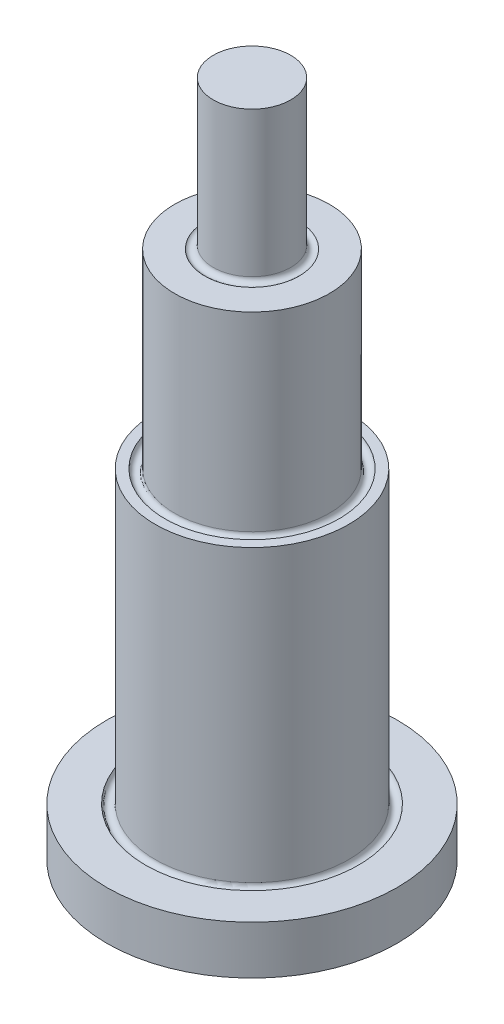
ISO-10303-21;
HEADER;
FILE_DESCRIPTION(('STEP AP214'),'2;1');
FILE_NAME('part.step','',(''),(''),'','','');
FILE_SCHEMA(('AUTOMOTIVE_DESIGN { 1 0 10303 214 1 1 1 1 }'));
ENDSEC;
DATA;
#1=APPLICATION_CONTEXT('core data for automotive mechanical design processes');
#2=APPLICATION_PROTOCOL_DEFINITION('international standard','automotive_design',2000,#1);
#3=PRODUCT_CONTEXT('',#1,'mechanical');
#4=PRODUCT('Part','Part','',(#3));
#5=PRODUCT_RELATED_PRODUCT_CATEGORY('part','',(#4));
#6=PRODUCT_DEFINITION_FORMATION('','',#4);
#7=PRODUCT_DEFINITION_CONTEXT('part definition',#1,'design');
#8=PRODUCT_DEFINITION('design','',#6,#7);
#9=PRODUCT_DEFINITION_SHAPE('','',#8);
#10=(LENGTH_UNIT() NAMED_UNIT(*) SI_UNIT(.MILLI.,.METRE.));
#11=(NAMED_UNIT(*) PLANE_ANGLE_UNIT() SI_UNIT($,.RADIAN.));
#12=(NAMED_UNIT(*) SI_UNIT($,.STERADIAN.) SOLID_ANGLE_UNIT());
#13=UNCERTAINTY_MEASURE_WITH_UNIT(LENGTH_MEASURE(1.E-05),#10,'distance_accuracy_value','');
#14=(GEOMETRIC_REPRESENTATION_CONTEXT(3) GLOBAL_UNCERTAINTY_ASSIGNED_CONTEXT((#13)) GLOBAL_UNIT_ASSIGNED_CONTEXT((#10,
#11,#12)) REPRESENTATION_CONTEXT('',''));
#15=CARTESIAN_POINT('',(0.,0.,0.));
#16=DIRECTION('',(0.,0.,1.));
#17=DIRECTION('',(1.,0.,0.));
#18=AXIS2_PLACEMENT_3D('',#15,#16,#17);
#19=CARTESIAN_POINT('',(0.,-35.,0.));
#20=DIRECTION('',(0.,1.,0.));
#21=DIRECTION('',(0.,0.,1.));
#22=AXIS2_PLACEMENT_3D('',#19,#20,#21);
#23=PLANE('',#22);
#24=CARTESIAN_POINT('',(0.,-35.,0.));
#25=DIRECTION('',(0.,-1.,0.));
#26=DIRECTION('',(0.,0.,-1.));
#27=AXIS2_PLACEMENT_3D('',#24,#25,#26);
#28=CIRCLE('',#27,15.);
#29=CARTESIAN_POINT('',(0.,-35.,-15.));
#30=VERTEX_POINT('',#29);
#31=EDGE_CURVE('E81',#30,#30,#28,.T.);
#32=ORIENTED_EDGE('',*,*,#31,.T.);
#33=EDGE_LOOP('',(#32));
#34=FACE_BOUND('',#33,.T.);
#35=ADVANCED_FACE('F32',(#34),#23,.F.);
#36=CARTESIAN_POINT('',(0.,35.,0.));
#37=DIRECTION('',(0.,-1.,0.));
#38=DIRECTION('',(0.,0.,-1.));
#39=AXIS2_PLACEMENT_3D('',#36,#37,#38);
#40=PLANE('',#39);
#41=CARTESIAN_POINT('',(0.,35.,0.));
#42=DIRECTION('',(0.,-1.,0.));
#43=DIRECTION('',(0.,0.,-1.));
#44=AXIS2_PLACEMENT_3D('',#41,#42,#43);
#45=CIRCLE('',#44,4.);
#46=CARTESIAN_POINT('',(0.,35.,-4.));
#47=VERTEX_POINT('',#46);
#48=EDGE_CURVE('E10',#47,#47,#45,.T.);
#49=ORIENTED_EDGE('',*,*,#48,.F.);
#50=EDGE_LOOP('',(#49));
#51=FACE_BOUND('',#50,.T.);
#52=ADVANCED_FACE('F143',(#51),#40,.F.);
#53=CARTESIAN_POINT('',(0.,0.,0.));
#54=DIRECTION('',(0.,-1.,0.));
#55=DIRECTION('',(0.,0.,-1.));
#56=AXIS2_PLACEMENT_3D('',#53,#54,#55);
#57=CYLINDRICAL_SURFACE('',#56,4.);
#58=CARTESIAN_POINT('',(0.,20.,0.));
#59=DIRECTION('',(0.,-1.,0.));
#60=DIRECTION('',(0.,0.,-1.));
#61=AXIS2_PLACEMENT_3D('',#58,#59,#60);
#62=CIRCLE('',#61,4.);
#63=CARTESIAN_POINT('',(0.,20.,-4.));
#64=VERTEX_POINT('',#63);
#65=EDGE_CURVE('E39',#64,#64,#62,.T.);
#66=ORIENTED_EDGE('',*,*,#65,.F.);
#67=EDGE_LOOP('',(#66));
#68=FACE_BOUND('',#67,.T.);
#69=ORIENTED_EDGE('',*,*,#48,.T.);
#70=EDGE_LOOP('',(#69));
#71=FACE_BOUND('',#70,.T.);
#72=ADVANCED_FACE('F138',(#68,#71),#57,.T.);
#73=CARTESIAN_POINT('',(0.,20.,0.));
#74=DIRECTION('',(0.,-1.,0.));
#75=DIRECTION('',(0.,0.,-1.));
#76=AXIS2_PLACEMENT_3D('',#73,#74,#75);
#77=TOROIDAL_SURFACE('',#76,4.5,0.5);
#78=CARTESIAN_POINT('',(0.,19.6654803093569,0.));
#79=DIRECTION('',(0.,-1.,0.));
#80=DIRECTION('',(0.,0.,-1.));
#81=AXIS2_PLACEMENT_3D('',#78,#79,#80);
#82=CIRCLE('',#81,4.87161347738218);
#83=CARTESIAN_POINT('',(0.,19.6654803093569,-4.87161347738218));
#84=VERTEX_POINT('',#83);
#85=EDGE_CURVE('E45',#84,#84,#82,.T.);
#86=ORIENTED_EDGE('',*,*,#85,.F.);
#87=EDGE_LOOP('',(#86));
#88=FACE_BOUND('',#87,.T.);
#89=ORIENTED_EDGE('',*,*,#65,.T.);
#90=EDGE_LOOP('',(#89));
#91=FACE_BOUND('',#90,.T.);
#92=ADVANCED_FACE('F133',(#88,#91),#77,.F.);
#93=CARTESIAN_POINT('',(-4.87161347738218,19.6654803093569,0.));
#94=DIRECTION('',(0.,-1.,0.));
#95=DIRECTION('',(0.,0.,-1.));
#96=AXIS2_PLACEMENT_3D('',#93,#94,#95);
#97=PLANE('',#96);
#98=CARTESIAN_POINT('',(0.,19.6654803093569,0.));
#99=DIRECTION('',(0.,-1.,0.));
#100=DIRECTION('',(0.,0.,-1.));
#101=AXIS2_PLACEMENT_3D('',#98,#99,#100);
#102=CIRCLE('',#101,8.);
#103=CARTESIAN_POINT('',(0.,19.6654803093569,-8.));
#104=VERTEX_POINT('',#103);
#105=EDGE_CURVE('E51',#104,#104,#102,.T.);
#106=ORIENTED_EDGE('',*,*,#105,.F.);
#107=EDGE_LOOP('',(#106));
#108=FACE_BOUND('',#107,.T.);
#109=ORIENTED_EDGE('',*,*,#85,.T.);
#110=EDGE_LOOP('',(#109));
#111=FACE_BOUND('',#110,.T.);
#112=ADVANCED_FACE('F127',(#108,#111),#97,.F.);
#113=CARTESIAN_POINT('',(0.,0.,0.));
#114=DIRECTION('',(0.,-1.,0.));
#115=DIRECTION('',(0.,0.,-1.));
#116=AXIS2_PLACEMENT_3D('',#113,#114,#115);
#117=CYLINDRICAL_SURFACE('',#116,8.);
#118=CARTESIAN_POINT('',(0.,0.,0.));
#119=DIRECTION('',(0.,-1.,0.));
#120=DIRECTION('',(0.,0.,-1.));
#121=AXIS2_PLACEMENT_3D('',#118,#119,#120);
#122=CIRCLE('',#121,8.);
#123=CARTESIAN_POINT('',(0.,0.,-8.));
#124=VERTEX_POINT('',#123);
#125=EDGE_CURVE('E57',#124,#124,#122,.T.);
#126=ORIENTED_EDGE('',*,*,#125,.F.);
#127=EDGE_LOOP('',(#126));
#128=FACE_BOUND('',#127,.T.);
#129=ORIENTED_EDGE('',*,*,#105,.T.);
#130=EDGE_LOOP('',(#129));
#131=FACE_BOUND('',#130,.T.);
#132=ADVANCED_FACE('F121',(#128,#131),#117,.T.);
#133=CARTESIAN_POINT('',(0.,0.,0.));
#134=DIRECTION('',(0.,-1.,0.));
#135=DIRECTION('',(0.,0.,-1.));
#136=AXIS2_PLACEMENT_3D('',#133,#134,#135);
#137=TOROIDAL_SURFACE('',#136,8.5,0.5);
#138=CARTESIAN_POINT('',(0.,0.,0.));
#139=DIRECTION('',(0.,-1.,0.));
#140=DIRECTION('',(0.,0.,-1.));
#141=AXIS2_PLACEMENT_3D('',#138,#139,#140);
#142=CIRCLE('',#141,9.);
#143=CARTESIAN_POINT('',(0.,0.,-9.));
#144=VERTEX_POINT('',#143);
#145=EDGE_CURVE('E61',#144,#144,#142,.T.);
#146=ORIENTED_EDGE('',*,*,#145,.F.);
#147=EDGE_LOOP('',(#146));
#148=FACE_BOUND('',#147,.T.);
#149=ORIENTED_EDGE('',*,*,#125,.T.);
#150=EDGE_LOOP('',(#149));
#151=FACE_BOUND('',#150,.T.);
#152=ADVANCED_FACE('F115',(#148,#151),#137,.F.);
#153=CARTESIAN_POINT('',(-9.,0.,0.));
#154=DIRECTION('',(0.,-1.,0.));
#155=DIRECTION('',(0.,0.,-1.));
#156=AXIS2_PLACEMENT_3D('',#153,#154,#155);
#157=PLANE('',#156);
#158=CARTESIAN_POINT('',(0.,0.,0.));
#159=DIRECTION('',(0.,-1.,0.));
#160=DIRECTION('',(0.,0.,-1.));
#161=AXIS2_PLACEMENT_3D('',#158,#159,#160);
#162=CIRCLE('',#161,10.);
#163=CARTESIAN_POINT('',(0.,0.,-10.));
#164=VERTEX_POINT('',#163);
#165=EDGE_CURVE('E65',#164,#164,#162,.T.);
#166=ORIENTED_EDGE('',*,*,#165,.F.);
#167=EDGE_LOOP('',(#166));
#168=FACE_BOUND('',#167,.T.);
#169=ORIENTED_EDGE('',*,*,#145,.T.);
#170=EDGE_LOOP('',(#169));
#171=FACE_BOUND('',#170,.T.);
#172=ADVANCED_FACE('F109',(#168,#171),#157,.F.);
#173=CARTESIAN_POINT('',(0.,0.,0.));
#174=DIRECTION('',(0.,-1.,0.));
#175=DIRECTION('',(0.,0.,-1.));
#176=AXIS2_PLACEMENT_3D('',#173,#174,#175);
#177=CYLINDRICAL_SURFACE('',#176,10.);
#178=CARTESIAN_POINT('',(0.,-30.,0.));
#179=DIRECTION('',(0.,-1.,0.));
#180=DIRECTION('',(0.,0.,-1.));
#181=AXIS2_PLACEMENT_3D('',#178,#179,#180);
#182=CIRCLE('',#181,10.);
#183=CARTESIAN_POINT('',(0.,-30.,-10.));
#184=VERTEX_POINT('',#183);
#185=EDGE_CURVE('E69',#184,#184,#182,.T.);
#186=ORIENTED_EDGE('',*,*,#185,.F.);
#187=EDGE_LOOP('',(#186));
#188=FACE_BOUND('',#187,.T.);
#189=ORIENTED_EDGE('',*,*,#165,.T.);
#190=EDGE_LOOP('',(#189));
#191=FACE_BOUND('',#190,.T.);
#192=ADVANCED_FACE('F103',(#188,#191),#177,.T.);
#193=CARTESIAN_POINT('',(0.,-30.,0.));
#194=DIRECTION('',(0.,-1.,0.));
#195=DIRECTION('',(0.,0.,-1.));
#196=AXIS2_PLACEMENT_3D('',#193,#194,#195);
#197=TOROIDAL_SURFACE('',#196,10.5,0.5);
#198=CARTESIAN_POINT('',(0.,-30.,0.));
#199=DIRECTION('',(0.,-1.,0.));
#200=DIRECTION('',(0.,0.,-1.));
#201=AXIS2_PLACEMENT_3D('',#198,#199,#200);
#202=CIRCLE('',#201,11.);
#203=CARTESIAN_POINT('',(0.,-30.,-11.));
#204=VERTEX_POINT('',#203);
#205=EDGE_CURVE('E73',#204,#204,#202,.T.);
#206=ORIENTED_EDGE('',*,*,#205,.F.);
#207=EDGE_LOOP('',(#206));
#208=FACE_BOUND('',#207,.T.);
#209=ORIENTED_EDGE('',*,*,#185,.T.);
#210=EDGE_LOOP('',(#209));
#211=FACE_BOUND('',#210,.T.);
#212=ADVANCED_FACE('F97',(#208,#211),#197,.F.);
#213=CARTESIAN_POINT('',(-11.,-30.,0.));
#214=DIRECTION('',(0.,-1.,0.));
#215=DIRECTION('',(0.,0.,-1.));
#216=AXIS2_PLACEMENT_3D('',#213,#214,#215);
#217=PLANE('',#216);
#218=CARTESIAN_POINT('',(0.,-30.,0.));
#219=DIRECTION('',(0.,-1.,0.));
#220=DIRECTION('',(0.,0.,-1.));
#221=AXIS2_PLACEMENT_3D('',#218,#219,#220);
#222=CIRCLE('',#221,15.);
#223=CARTESIAN_POINT('',(0.,-30.,-15.));
#224=VERTEX_POINT('',#223);
#225=EDGE_CURVE('E77',#224,#224,#222,.T.);
#226=ORIENTED_EDGE('',*,*,#225,.F.);
#227=EDGE_LOOP('',(#226));
#228=FACE_BOUND('',#227,.T.);
#229=ORIENTED_EDGE('',*,*,#205,.T.);
#230=EDGE_LOOP('',(#229));
#231=FACE_BOUND('',#230,.T.);
#232=ADVANCED_FACE('F91',(#228,#231),#217,.F.);
#233=CARTESIAN_POINT('',(0.,0.,0.));
#234=DIRECTION('',(0.,-1.,0.));
#235=DIRECTION('',(0.,0.,-1.));
#236=AXIS2_PLACEMENT_3D('',#233,#234,#235);
#237=CYLINDRICAL_SURFACE('',#236,15.);
#238=ORIENTED_EDGE('',*,*,#31,.F.);
#239=EDGE_LOOP('',(#238));
#240=FACE_BOUND('',#239,.T.);
#241=ORIENTED_EDGE('',*,*,#225,.T.);
#242=EDGE_LOOP('',(#241));
#243=FACE_BOUND('',#242,.T.);
#244=ADVANCED_FACE('F88',(#240,#243),#237,.T.);
#245=CLOSED_SHELL('',(#35,#52,#72,#92,#112,#132,#152,#172,#192,#212,#232,#244));
#246=MANIFOLD_SOLID_BREP('B2',#245);
#247=ADVANCED_BREP_SHAPE_REPRESENTATION('',(#18,#246),#14);
#248=SHAPE_DEFINITION_REPRESENTATION(#9,#247);
ENDSEC;
END-ISO-10303-21;
